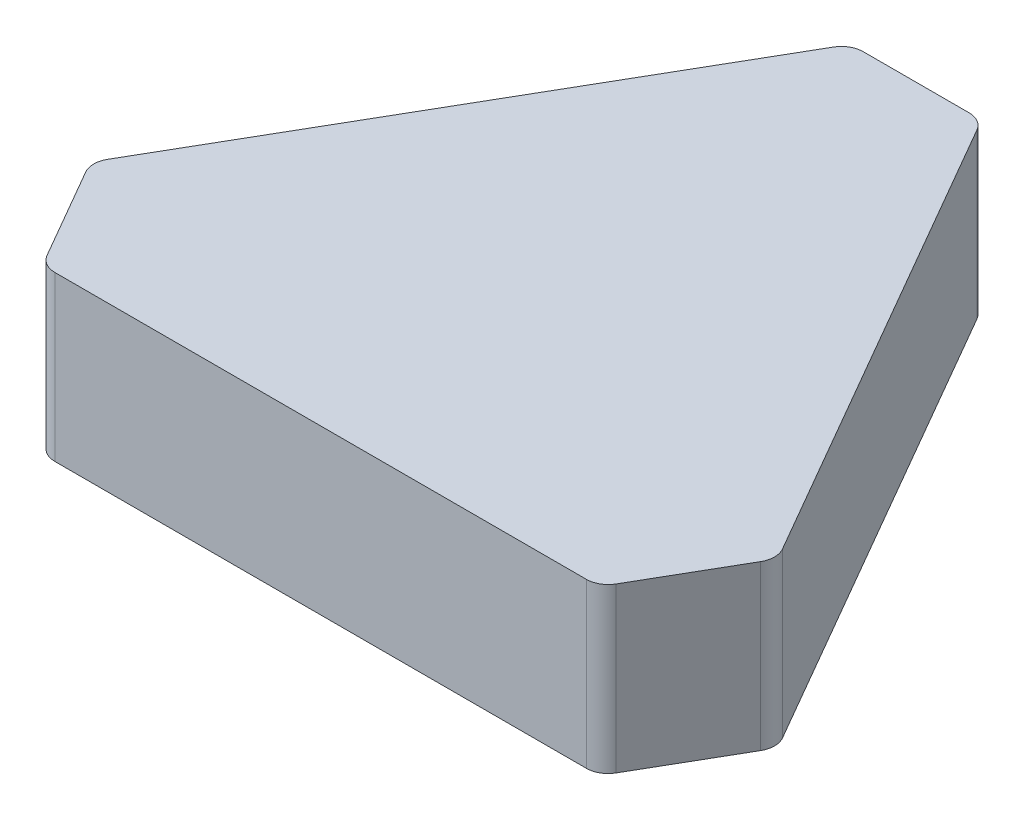
ISO-10303-21;
HEADER;
FILE_DESCRIPTION(('STEP AP214'),'2;1');
FILE_NAME('part.step','',(''),(''),'','','');
FILE_SCHEMA(('AUTOMOTIVE_DESIGN { 1 0 10303 214 1 1 1 1 }'));
ENDSEC;
DATA;
#1=APPLICATION_CONTEXT('core data for automotive mechanical design processes');
#2=APPLICATION_PROTOCOL_DEFINITION('international standard','automotive_design',2000,#1);
#3=PRODUCT_CONTEXT('',#1,'mechanical');
#4=PRODUCT('Part','Part','',(#3));
#5=PRODUCT_RELATED_PRODUCT_CATEGORY('part','',(#4));
#6=PRODUCT_DEFINITION_FORMATION('','',#4);
#7=PRODUCT_DEFINITION_CONTEXT('part definition',#1,'design');
#8=PRODUCT_DEFINITION('design','',#6,#7);
#9=PRODUCT_DEFINITION_SHAPE('','',#8);
#10=(LENGTH_UNIT() NAMED_UNIT(*) SI_UNIT(.MILLI.,.METRE.));
#11=(NAMED_UNIT(*) PLANE_ANGLE_UNIT() SI_UNIT($,.RADIAN.));
#12=(NAMED_UNIT(*) SI_UNIT($,.STERADIAN.) SOLID_ANGLE_UNIT());
#13=UNCERTAINTY_MEASURE_WITH_UNIT(LENGTH_MEASURE(1.E-05),#10,'distance_accuracy_value','');
#14=(GEOMETRIC_REPRESENTATION_CONTEXT(3) GLOBAL_UNCERTAINTY_ASSIGNED_CONTEXT((#13)) GLOBAL_UNIT_ASSIGNED_CONTEXT((#10,
#11,#12)) REPRESENTATION_CONTEXT('',''));
#15=CARTESIAN_POINT('',(0.,0.,0.));
#16=DIRECTION('',(0.,0.,1.));
#17=DIRECTION('',(1.,0.,0.));
#18=AXIS2_PLACEMENT_3D('',#15,#16,#17);
#19=CARTESIAN_POINT('',(0.,15.,0.));
#20=DIRECTION('',(-0.866025403784436,0.,-0.500000000000004));
#21=DIRECTION('',(-0.500000000000004,0.,0.866025403784436));
#22=AXIS2_PLACEMENT_3D('',#19,#20,#21);
#23=PLANE('',#22);
#24=DIRECTION('',(0.500000000000004,0.,-0.866025403784436));
#25=VECTOR('',#24,1.);
#26=CARTESIAN_POINT('',(0.,15.,0.));
#27=LINE('',#26,#25);
#28=CARTESIAN_POINT('',(6.57735026918967,15.,-11.3923048454132));
#29=VERTEX_POINT('',#28);
#30=CARTESIAN_POINT('',(30.9226497308105,15.,-53.5596004384193));
#31=VERTEX_POINT('',#30);
#32=EDGE_CURVE('E249',#29,#31,#27,.T.);
#33=ORIENTED_EDGE('',*,*,#32,.T.);
#34=DIRECTION('',(0.,1.,0.));
#35=VECTOR('',#34,1.);
#36=CARTESIAN_POINT('',(30.9226497308105,0.,-53.5596004384193));
#37=LINE('',#36,#35);
#38=CARTESIAN_POINT('',(30.9226497308105,0.,-53.5596004384193));
#39=VERTEX_POINT('',#38);
#40=EDGE_CURVE('E223',#31,#39,#37,.F.);
#41=ORIENTED_EDGE('',*,*,#40,.T.);
#42=DIRECTION('',(0.500000000000004,0.,-0.866025403784436));
#43=VECTOR('',#42,1.);
#44=CARTESIAN_POINT('',(0.,0.,0.));
#45=LINE('',#44,#43);
#46=CARTESIAN_POINT('',(6.57735026918967,0.,-11.3923048454132));
#47=VERTEX_POINT('',#46);
#48=EDGE_CURVE('E158',#47,#39,#45,.T.);
#49=ORIENTED_EDGE('',*,*,#48,.F.);
#50=DIRECTION('',(0.,1.,0.));
#51=VECTOR('',#50,1.);
#52=CARTESIAN_POINT('',(6.57735026918966,15.,-11.3923048454132));
#53=LINE('',#52,#51);
#54=EDGE_CURVE('E219',#47,#29,#53,.T.);
#55=ORIENTED_EDGE('',*,*,#54,.T.);
#56=EDGE_LOOP('',(#33,#41,#49,#55));
#57=FACE_BOUND('',#56,.T.);
#58=ADVANCED_FACE('F46',(#57),#23,.T.);
#59=CARTESIAN_POINT('',(0.,15.,0.));
#60=DIRECTION('',(0.,0.,1.));
#61=DIRECTION('',(1.,0.,0.));
#62=AXIS2_PLACEMENT_3D('',#59,#60,#61);
#63=PLANE('',#62);
#64=DIRECTION('',(-1.,0.,0.));
#65=VECTOR('',#64,1.);
#66=CARTESIAN_POINT('',(0.,0.,0.));
#67=LINE('',#66,#65);
#68=CARTESIAN_POINT('',(61.8452994616204,0.,0.));
#69=VERTEX_POINT('',#68);
#70=CARTESIAN_POINT('',(13.1547005383793,0.,0.));
#71=VERTEX_POINT('',#70);
#72=EDGE_CURVE('E138',#69,#71,#67,.T.);
#73=ORIENTED_EDGE('',*,*,#72,.F.);
#74=DIRECTION('',(0.,1.,0.));
#75=VECTOR('',#74,1.);
#76=CARTESIAN_POINT('',(61.8452994616204,15.,0.));
#77=LINE('',#76,#75);
#78=CARTESIAN_POINT('',(61.8452994616204,15.,0.));
#79=VERTEX_POINT('',#78);
#80=EDGE_CURVE('E152',#69,#79,#77,.T.);
#81=ORIENTED_EDGE('',*,*,#80,.T.);
#82=DIRECTION('',(-1.,0.,0.));
#83=VECTOR('',#82,1.);
#84=CARTESIAN_POINT('',(0.,15.,0.));
#85=LINE('',#84,#83);
#86=CARTESIAN_POINT('',(13.1547005383793,15.,0.));
#87=VERTEX_POINT('',#86);
#88=EDGE_CURVE('E253',#79,#87,#85,.T.);
#89=ORIENTED_EDGE('',*,*,#88,.T.);
#90=DIRECTION('',(0.,1.,0.));
#91=VECTOR('',#90,1.);
#92=CARTESIAN_POINT('',(13.1547005383793,0.,0.));
#93=LINE('',#92,#91);
#94=EDGE_CURVE('E155',#87,#71,#93,.F.);
#95=ORIENTED_EDGE('',*,*,#94,.T.);
#96=EDGE_LOOP('',(#73,#81,#89,#95));
#97=FACE_BOUND('',#96,.T.);
#98=ADVANCED_FACE('F150',(#97),#63,.T.);
#99=CARTESIAN_POINT('',(56.2499999999997,15.,-32.4759526419166));
#100=DIRECTION('',(0.866025403784436,0.,-0.500000000000004));
#101=DIRECTION('',(-0.500000000000004,0.,-0.866025403784436));
#102=AXIS2_PLACEMENT_3D('',#99,#100,#101);
#103=PLANE('',#102);
#104=DIRECTION('',(0.500000000000005,0.,0.866025403784436));
#105=VECTOR('',#104,1.);
#106=CARTESIAN_POINT('',(56.2499999999997,15.,-32.4759526419166));
#107=LINE('',#106,#105);
#108=CARTESIAN_POINT('',(44.0773502691895,15.,-53.5596004384193));
#109=VERTEX_POINT('',#108);
#110=CARTESIAN_POINT('',(68.4226497308101,15.,-11.3923048454137));
#111=VERTEX_POINT('',#110);
#112=EDGE_CURVE('E169',#109,#111,#107,.T.);
#113=ORIENTED_EDGE('',*,*,#112,.T.);
#114=DIRECTION('',(0.,1.,0.));
#115=VECTOR('',#114,1.);
#116=CARTESIAN_POINT('',(68.4226497308101,0.,-11.3923048454137));
#117=LINE('',#116,#115);
#118=CARTESIAN_POINT('',(68.4226497308101,0.,-11.3923048454137));
#119=VERTEX_POINT('',#118);
#120=EDGE_CURVE('E209',#111,#119,#117,.F.);
#121=ORIENTED_EDGE('',*,*,#120,.T.);
#122=DIRECTION('',(0.500000000000005,0.,0.866025403784436));
#123=VECTOR('',#122,1.);
#124=CARTESIAN_POINT('',(56.2499999999997,0.,-32.4759526419166));
#125=LINE('',#124,#123);
#126=CARTESIAN_POINT('',(44.0773502691895,0.,-53.5596004384193));
#127=VERTEX_POINT('',#126);
#128=EDGE_CURVE('E157',#127,#119,#125,.T.);
#129=ORIENTED_EDGE('',*,*,#128,.F.);
#130=DIRECTION('',(0.,1.,0.));
#131=VECTOR('',#130,1.);
#132=CARTESIAN_POINT('',(44.0773502691895,15.,-53.5596004384192));
#133=LINE('',#132,#131);
#134=EDGE_CURVE('E145',#127,#109,#133,.T.);
#135=ORIENTED_EDGE('',*,*,#134,.T.);
#136=EDGE_LOOP('',(#113,#121,#129,#135));
#137=FACE_BOUND('',#136,.T.);
#138=ADVANCED_FACE('F296',(#137),#103,.T.);
#139=CARTESIAN_POINT('',(0.,15.,0.));
#140=DIRECTION('',(0.,1.,0.));
#141=DIRECTION('',(0.,0.,1.));
#142=AXIS2_PLACEMENT_3D('',#139,#140,#141);
#143=PLANE('',#142);
#144=ORIENTED_EDGE('',*,*,#88,.F.);
#145=CARTESIAN_POINT('',(61.8452994616204,15.,-2.));
#146=DIRECTION('',(0.,1.,0.));
#147=DIRECTION('',(0.,0.,1.));
#148=AXIS2_PLACEMENT_3D('',#145,#146,#147);
#149=CIRCLE('',#148,2.);
#150=CARTESIAN_POINT('',(63.5773502691893,15.,-1.00000000000002));
#151=VERTEX_POINT('',#150);
#152=EDGE_CURVE('E161',#79,#151,#149,.T.);
#153=ORIENTED_EDGE('',*,*,#152,.T.);
#154=DIRECTION('',(-0.499999999999987,0.,0.866025403784446));
#155=VECTOR('',#154,1.);
#156=CARTESIAN_POINT('',(47.2500000000006,15.,27.2798002192092));
#157=LINE('',#156,#155);
#158=CARTESIAN_POINT('',(68.4226497308101,15.,-9.39230484541369));
#159=VERTEX_POINT('',#158);
#160=EDGE_CURVE('E238',#159,#151,#157,.T.);
#161=ORIENTED_EDGE('',*,*,#160,.F.);
#162=CARTESIAN_POINT('',(66.6905989232412,15.,-10.3923048454137));
#163=DIRECTION('',(0.,1.,0.));
#164=DIRECTION('',(0.,0.,1.));
#165=AXIS2_PLACEMENT_3D('',#162,#163,#164);
#166=CIRCLE('',#165,2.);
#167=EDGE_CURVE('E181',#159,#111,#166,.T.);
#168=ORIENTED_EDGE('',*,*,#167,.T.);
#169=ORIENTED_EDGE('',*,*,#112,.F.);
#170=CARTESIAN_POINT('',(42.3452994616206,15.,-52.5596004384192));
#171=DIRECTION('',(0.,1.,0.));
#172=DIRECTION('',(0.,0.,1.));
#173=AXIS2_PLACEMENT_3D('',#170,#171,#172);
#174=CIRCLE('',#173,2.);
#175=CARTESIAN_POINT('',(42.3452994616206,15.,-54.5596004384192));
#176=VERTEX_POINT('',#175);
#177=EDGE_CURVE('E178',#109,#176,#174,.T.);
#178=ORIENTED_EDGE('',*,*,#177,.T.);
#179=DIRECTION('',(1.,0.,0.));
#180=VECTOR('',#179,1.);
#181=CARTESIAN_POINT('',(0.,15.,-54.5596004384193));
#182=LINE('',#181,#180);
#183=CARTESIAN_POINT('',(32.6547005383793,15.,-54.5596004384192));
#184=VERTEX_POINT('',#183);
#185=EDGE_CURVE('E237',#184,#176,#182,.T.);
#186=ORIENTED_EDGE('',*,*,#185,.F.);
#187=CARTESIAN_POINT('',(32.6547005383793,15.,-52.5596004384192));
#188=DIRECTION('',(0.,1.,0.));
#189=DIRECTION('',(0.,0.,1.));
#190=AXIS2_PLACEMENT_3D('',#187,#188,#189);
#191=CIRCLE('',#190,2.);
#192=EDGE_CURVE('E175',#184,#31,#191,.T.);
#193=ORIENTED_EDGE('',*,*,#192,.T.);
#194=ORIENTED_EDGE('',*,*,#32,.F.);
#195=CARTESIAN_POINT('',(8.30940107675854,15.,-10.3923048454132));
#196=DIRECTION('',(0.,1.,0.));
#197=DIRECTION('',(0.,0.,1.));
#198=AXIS2_PLACEMENT_3D('',#195,#196,#197);
#199=CIRCLE('',#198,2.);
#200=CARTESIAN_POINT('',(6.57735026918966,15.,-9.39230484541321));
#201=VERTEX_POINT('',#200);
#202=EDGE_CURVE('E167',#29,#201,#199,.T.);
#203=ORIENTED_EDGE('',*,*,#202,.T.);
#204=DIRECTION('',(-0.5,0.,-0.866025403784439));
#205=VECTOR('',#204,1.);
#206=CARTESIAN_POINT('',(9.,15.,-5.19615242270663));
#207=LINE('',#206,#205);
#208=CARTESIAN_POINT('',(11.4226497308104,15.,-0.999999999999999));
#209=VERTEX_POINT('',#208);
#210=EDGE_CURVE('E230',#209,#201,#207,.T.);
#211=ORIENTED_EDGE('',*,*,#210,.F.);
#212=CARTESIAN_POINT('',(13.1547005383793,15.,-2.));
#213=DIRECTION('',(0.,1.,0.));
#214=DIRECTION('',(0.,0.,1.));
#215=AXIS2_PLACEMENT_3D('',#212,#213,#214);
#216=CIRCLE('',#215,2.);
#217=EDGE_CURVE('E163',#209,#87,#216,.T.);
#218=ORIENTED_EDGE('',*,*,#217,.T.);
#219=EDGE_LOOP('',(#144,#153,#161,#168,#169,#178,#186,#193,#194,#203,#211,#218));
#220=FACE_BOUND('',#219,.T.);
#221=ADVANCED_FACE('F234',(#220),#143,.T.);
#222=CARTESIAN_POINT('',(0.,0.,0.));
#223=DIRECTION('',(0.,1.,0.));
#224=DIRECTION('',(0.,0.,1.));
#225=AXIS2_PLACEMENT_3D('',#222,#223,#224);
#226=PLANE('',#225);
#227=CARTESIAN_POINT('',(37.4999999999999,0.,-21.6506350946108));
#228=DIRECTION('',(0.,-1.,0.));
#229=DIRECTION('',(0.,0.,-1.));
#230=AXIS2_PLACEMENT_3D('',#227,#228,#229);
#231=CIRCLE('',#230,13.6506350946108);
#232=CARTESIAN_POINT('',(37.4999999999999,0.,-35.3012701892217));
#233=VERTEX_POINT('',#232);
#234=EDGE_CURVE('E326',#233,#233,#231,.T.);
#235=ORIENTED_EDGE('',*,*,#234,.F.);
#236=EDGE_LOOP('',(#235));
#237=FACE_BOUND('',#236,.T.);
#238=DIRECTION('',(-0.499999999999986,0.,0.866025403784446));
#239=VECTOR('',#238,1.);
#240=CARTESIAN_POINT('',(68.9999999999995,0.,-10.3923048454134));
#241=LINE('',#240,#239);
#242=CARTESIAN_POINT('',(68.4226497308101,0.,-9.39230484541369));
#243=VERTEX_POINT('',#242);
#244=CARTESIAN_POINT('',(63.5773502691893,0.,-1.00000000000003));
#245=VERTEX_POINT('',#244);
#246=EDGE_CURVE('E140',#243,#245,#241,.T.);
#247=ORIENTED_EDGE('',*,*,#246,.T.);
#248=CARTESIAN_POINT('',(61.8452994616204,0.,-2.));
#249=DIRECTION('',(0.,1.,0.));
#250=DIRECTION('',(0.,0.,1.));
#251=AXIS2_PLACEMENT_3D('',#248,#249,#250);
#252=CIRCLE('',#251,2.);
#253=EDGE_CURVE('E135',#245,#69,#252,.F.);
#254=ORIENTED_EDGE('',*,*,#253,.T.);
#255=ORIENTED_EDGE('',*,*,#72,.T.);
#256=CARTESIAN_POINT('',(13.1547005383793,0.,-2.));
#257=DIRECTION('',(0.,1.,0.));
#258=DIRECTION('',(0.,0.,1.));
#259=AXIS2_PLACEMENT_3D('',#256,#257,#258);
#260=CIRCLE('',#259,2.);
#261=CARTESIAN_POINT('',(11.4226497308104,0.,-1.));
#262=VERTEX_POINT('',#261);
#263=EDGE_CURVE('E67',#71,#262,#260,.F.);
#264=ORIENTED_EDGE('',*,*,#263,.T.);
#265=DIRECTION('',(-0.5,0.,-0.866025403784439));
#266=VECTOR('',#265,1.);
#267=CARTESIAN_POINT('',(6.,0.,-10.3923048454133));
#268=LINE('',#267,#266);
#269=CARTESIAN_POINT('',(6.57735026918966,0.,-9.39230484541321));
#270=VERTEX_POINT('',#269);
#271=EDGE_CURVE('E231',#262,#270,#268,.T.);
#272=ORIENTED_EDGE('',*,*,#271,.T.);
#273=CARTESIAN_POINT('',(8.30940107675854,0.,-10.3923048454132));
#274=DIRECTION('',(0.,1.,0.));
#275=DIRECTION('',(0.,0.,1.));
#276=AXIS2_PLACEMENT_3D('',#273,#274,#275);
#277=CIRCLE('',#276,2.);
#278=EDGE_CURVE('E195',#270,#47,#277,.F.);
#279=ORIENTED_EDGE('',*,*,#278,.T.);
#280=ORIENTED_EDGE('',*,*,#48,.T.);
#281=CARTESIAN_POINT('',(32.6547005383793,0.,-52.5596004384192));
#282=DIRECTION('',(0.,1.,0.));
#283=DIRECTION('',(0.,0.,1.));
#284=AXIS2_PLACEMENT_3D('',#281,#282,#283);
#285=CIRCLE('',#284,2.);
#286=CARTESIAN_POINT('',(32.6547005383793,0.,-54.5596004384192));
#287=VERTEX_POINT('',#286);
#288=EDGE_CURVE('E198',#39,#287,#285,.F.);
#289=ORIENTED_EDGE('',*,*,#288,.T.);
#290=DIRECTION('',(1.,0.,0.));
#291=VECTOR('',#290,1.);
#292=CARTESIAN_POINT('',(31.4999999999998,0.,-54.5596004384192));
#293=LINE('',#292,#291);
#294=CARTESIAN_POINT('',(42.3452994616206,0.,-54.5596004384192));
#295=VERTEX_POINT('',#294);
#296=EDGE_CURVE('E245',#287,#295,#293,.T.);
#297=ORIENTED_EDGE('',*,*,#296,.T.);
#298=CARTESIAN_POINT('',(42.3452994616206,0.,-52.5596004384192));
#299=DIRECTION('',(0.,1.,0.));
#300=DIRECTION('',(0.,0.,1.));
#301=AXIS2_PLACEMENT_3D('',#298,#299,#300);
#302=CIRCLE('',#301,2.);
#303=EDGE_CURVE('E201',#295,#127,#302,.F.);
#304=ORIENTED_EDGE('',*,*,#303,.T.);
#305=ORIENTED_EDGE('',*,*,#128,.T.);
#306=CARTESIAN_POINT('',(66.6905989232412,0.,-10.3923048454137));
#307=DIRECTION('',(0.,1.,0.));
#308=DIRECTION('',(0.,0.,1.));
#309=AXIS2_PLACEMENT_3D('',#306,#307,#308);
#310=CIRCLE('',#309,2.);
#311=EDGE_CURVE('E146',#119,#243,#310,.F.);
#312=ORIENTED_EDGE('',*,*,#311,.T.);
#313=EDGE_LOOP('',(#247,#254,#255,#264,#272,#279,#280,#289,#297,#304,#305,#312));
#314=FACE_BOUND('',#313,.T.);
#315=ADVANCED_FACE('F137',(#237,#314),#226,.F.);
#316=CARTESIAN_POINT('',(68.9999999999995,0.,-10.3923048454134));
#317=DIRECTION('',(-0.866025403784446,0.,-0.499999999999987));
#318=DIRECTION('',(-0.499999999999987,0.,0.866025403784446));
#319=AXIS2_PLACEMENT_3D('',#316,#317,#318);
#320=PLANE('',#319);
#321=ORIENTED_EDGE('',*,*,#160,.T.);
#322=DIRECTION('',(0.,1.,0.));
#323=VECTOR('',#322,1.);
#324=CARTESIAN_POINT('',(63.5773502691893,0.,-1.00000000000003));
#325=LINE('',#324,#323);
#326=EDGE_CURVE('E190',#151,#245,#325,.F.);
#327=ORIENTED_EDGE('',*,*,#326,.T.);
#328=ORIENTED_EDGE('',*,*,#246,.F.);
#329=DIRECTION('',(0.,1.,0.));
#330=VECTOR('',#329,1.);
#331=CARTESIAN_POINT('',(68.4226497308101,15.,-9.39230484541369));
#332=LINE('',#331,#330);
#333=EDGE_CURVE('E186',#243,#159,#332,.T.);
#334=ORIENTED_EDGE('',*,*,#333,.T.);
#335=EDGE_LOOP('',(#321,#327,#328,#334));
#336=FACE_BOUND('',#335,.T.);
#337=ADVANCED_FACE('F275',(#336),#320,.F.);
#338=CARTESIAN_POINT('',(6.,0.,-10.3923048454133));
#339=DIRECTION('',(0.866025403784439,0.,-0.5));
#340=DIRECTION('',(-0.5,0.,-0.866025403784439));
#341=AXIS2_PLACEMENT_3D('',#338,#339,#340);
#342=PLANE('',#341);
#343=ORIENTED_EDGE('',*,*,#210,.T.);
#344=DIRECTION('',(0.,1.,0.));
#345=VECTOR('',#344,1.);
#346=CARTESIAN_POINT('',(6.57735026918966,0.,-9.39230484541321));
#347=LINE('',#346,#345);
#348=EDGE_CURVE('E11',#201,#270,#347,.F.);
#349=ORIENTED_EDGE('',*,*,#348,.T.);
#350=ORIENTED_EDGE('',*,*,#271,.F.);
#351=DIRECTION('',(0.,1.,0.));
#352=VECTOR('',#351,1.);
#353=CARTESIAN_POINT('',(11.4226497308104,15.,-1.));
#354=LINE('',#353,#352);
#355=EDGE_CURVE('E55',#262,#209,#354,.T.);
#356=ORIENTED_EDGE('',*,*,#355,.T.);
#357=EDGE_LOOP('',(#343,#349,#350,#356));
#358=FACE_BOUND('',#357,.T.);
#359=ADVANCED_FACE('F229',(#358),#342,.F.);
#360=CARTESIAN_POINT('',(31.4999999999998,0.,-54.5596004384192));
#361=DIRECTION('',(0.,0.,1.));
#362=DIRECTION('',(1.,0.,0.));
#363=AXIS2_PLACEMENT_3D('',#360,#361,#362);
#364=PLANE('',#363);
#365=ORIENTED_EDGE('',*,*,#185,.T.);
#366=DIRECTION('',(0.,1.,0.));
#367=VECTOR('',#366,1.);
#368=CARTESIAN_POINT('',(42.3452994616206,0.,-54.5596004384192));
#369=LINE('',#368,#367);
#370=EDGE_CURVE('E216',#176,#295,#369,.F.);
#371=ORIENTED_EDGE('',*,*,#370,.T.);
#372=ORIENTED_EDGE('',*,*,#296,.F.);
#373=DIRECTION('',(0.,1.,0.));
#374=VECTOR('',#373,1.);
#375=CARTESIAN_POINT('',(32.6547005383793,15.,-54.5596004384192));
#376=LINE('',#375,#374);
#377=EDGE_CURVE('E212',#287,#184,#376,.T.);
#378=ORIENTED_EDGE('',*,*,#377,.T.);
#379=EDGE_LOOP('',(#365,#371,#372,#378));
#380=FACE_BOUND('',#379,.T.);
#381=ADVANCED_FACE('F302',(#380),#364,.F.);
#382=CARTESIAN_POINT('',(61.8452994616204,15.,-2.));
#383=DIRECTION('',(0.,-1.,0.));
#384=DIRECTION('',(0.,0.,-1.));
#385=AXIS2_PLACEMENT_3D('',#382,#383,#384);
#386=CYLINDRICAL_SURFACE('',#385,2.);
#387=ORIENTED_EDGE('',*,*,#253,.F.);
#388=ORIENTED_EDGE('',*,*,#326,.F.);
#389=ORIENTED_EDGE('',*,*,#152,.F.);
#390=ORIENTED_EDGE('',*,*,#80,.F.);
#391=EDGE_LOOP('',(#387,#388,#389,#390));
#392=FACE_BOUND('',#391,.T.);
#393=ADVANCED_FACE('F160',(#392),#386,.T.);
#394=CARTESIAN_POINT('',(66.6905989232412,0.,-10.3923048454137));
#395=DIRECTION('',(0.,-1.,0.));
#396=DIRECTION('',(0.,0.,-1.));
#397=AXIS2_PLACEMENT_3D('',#394,#395,#396);
#398=CYLINDRICAL_SURFACE('',#397,2.);
#399=ORIENTED_EDGE('',*,*,#311,.F.);
#400=ORIENTED_EDGE('',*,*,#120,.F.);
#401=ORIENTED_EDGE('',*,*,#167,.F.);
#402=ORIENTED_EDGE('',*,*,#333,.F.);
#403=EDGE_LOOP('',(#399,#400,#401,#402));
#404=FACE_BOUND('',#403,.T.);
#405=ADVANCED_FACE('F272',(#404),#398,.T.);
#406=CARTESIAN_POINT('',(42.3452994616206,15.,-52.5596004384192));
#407=DIRECTION('',(0.,-1.,0.));
#408=DIRECTION('',(0.,0.,-1.));
#409=AXIS2_PLACEMENT_3D('',#406,#407,#408);
#410=CYLINDRICAL_SURFACE('',#409,2.);
#411=ORIENTED_EDGE('',*,*,#303,.F.);
#412=ORIENTED_EDGE('',*,*,#370,.F.);
#413=ORIENTED_EDGE('',*,*,#177,.F.);
#414=ORIENTED_EDGE('',*,*,#134,.F.);
#415=EDGE_LOOP('',(#411,#412,#413,#414));
#416=FACE_BOUND('',#415,.T.);
#417=ADVANCED_FACE('F305',(#416),#410,.T.);
#418=CARTESIAN_POINT('',(32.6547005383793,0.,-52.5596004384192));
#419=DIRECTION('',(0.,-1.,0.));
#420=DIRECTION('',(0.,0.,-1.));
#421=AXIS2_PLACEMENT_3D('',#418,#419,#420);
#422=CYLINDRICAL_SURFACE('',#421,2.);
#423=ORIENTED_EDGE('',*,*,#288,.F.);
#424=ORIENTED_EDGE('',*,*,#40,.F.);
#425=ORIENTED_EDGE('',*,*,#192,.F.);
#426=ORIENTED_EDGE('',*,*,#377,.F.);
#427=EDGE_LOOP('',(#423,#424,#425,#426));
#428=FACE_BOUND('',#427,.T.);
#429=ADVANCED_FACE('F288',(#428),#422,.T.);
#430=CARTESIAN_POINT('',(8.30940107675854,15.,-10.3923048454132));
#431=DIRECTION('',(0.,-1.,0.));
#432=DIRECTION('',(0.,0.,-1.));
#433=AXIS2_PLACEMENT_3D('',#430,#431,#432);
#434=CYLINDRICAL_SURFACE('',#433,2.);
#435=ORIENTED_EDGE('',*,*,#278,.F.);
#436=ORIENTED_EDGE('',*,*,#348,.F.);
#437=ORIENTED_EDGE('',*,*,#202,.F.);
#438=ORIENTED_EDGE('',*,*,#54,.F.);
#439=EDGE_LOOP('',(#435,#436,#437,#438));
#440=FACE_BOUND('',#439,.T.);
#441=ADVANCED_FACE('F279',(#440),#434,.T.);
#442=CARTESIAN_POINT('',(13.1547005383793,0.,-2.));
#443=DIRECTION('',(0.,-1.,0.));
#444=DIRECTION('',(0.,0.,-1.));
#445=AXIS2_PLACEMENT_3D('',#442,#443,#444);
#446=CYLINDRICAL_SURFACE('',#445,2.);
#447=ORIENTED_EDGE('',*,*,#263,.F.);
#448=ORIENTED_EDGE('',*,*,#94,.F.);
#449=ORIENTED_EDGE('',*,*,#217,.F.);
#450=ORIENTED_EDGE('',*,*,#355,.F.);
#451=EDGE_LOOP('',(#447,#448,#449,#450));
#452=FACE_BOUND('',#451,.T.);
#453=ADVANCED_FACE('F48',(#452),#446,.T.);
#454=CARTESIAN_POINT('',(37.4999999999999,3.,-21.6506350946108));
#455=DIRECTION('',(0.,-1.,0.));
#456=DIRECTION('',(0.,0.,-1.));
#457=AXIS2_PLACEMENT_3D('',#454,#455,#456);
#458=CYLINDRICAL_SURFACE('',#457,13.6506350946108);
#459=CARTESIAN_POINT('',(37.4999999999999,3.,-21.6506350946108));
#460=DIRECTION('',(0.,-1.,0.));
#461=DIRECTION('',(0.,0.,-1.));
#462=AXIS2_PLACEMENT_3D('',#459,#460,#461);
#463=CIRCLE('',#462,13.6506350946108);
#464=CARTESIAN_POINT('',(37.4999999999999,3.,-35.3012701892217));
#465=VERTEX_POINT('',#464);
#466=EDGE_CURVE('E329',#465,#465,#463,.T.);
#467=ORIENTED_EDGE('',*,*,#466,.F.);
#468=EDGE_LOOP('',(#467));
#469=FACE_BOUND('',#468,.T.);
#470=ORIENTED_EDGE('',*,*,#234,.T.);
#471=EDGE_LOOP('',(#470));
#472=FACE_BOUND('',#471,.T.);
#473=ADVANCED_FACE('F278',(#469,#472),#458,.F.);
#474=CARTESIAN_POINT('',(37.4999999999999,3.,-21.6506350946108));
#475=DIRECTION('',(0.,-1.,0.));
#476=DIRECTION('',(0.,0.,-1.));
#477=AXIS2_PLACEMENT_3D('',#474,#475,#476);
#478=PLANE('',#477);
#479=ORIENTED_EDGE('',*,*,#466,.T.);
#480=EDGE_LOOP('',(#479));
#481=FACE_BOUND('',#480,.T.);
#482=ADVANCED_FACE('F285',(#481),#478,.T.);
#483=CLOSED_SHELL('',(#58,#98,#138,#221,#315,#337,#359,#381,#393,#405,#417,#429,#441,#453,#473,#482));
#484=MANIFOLD_SOLID_BREP('B2',#483);
#485=ADVANCED_BREP_SHAPE_REPRESENTATION('',(#18,#484),#14);
#486=SHAPE_DEFINITION_REPRESENTATION(#9,#485);
ENDSEC;
END-ISO-10303-21;
